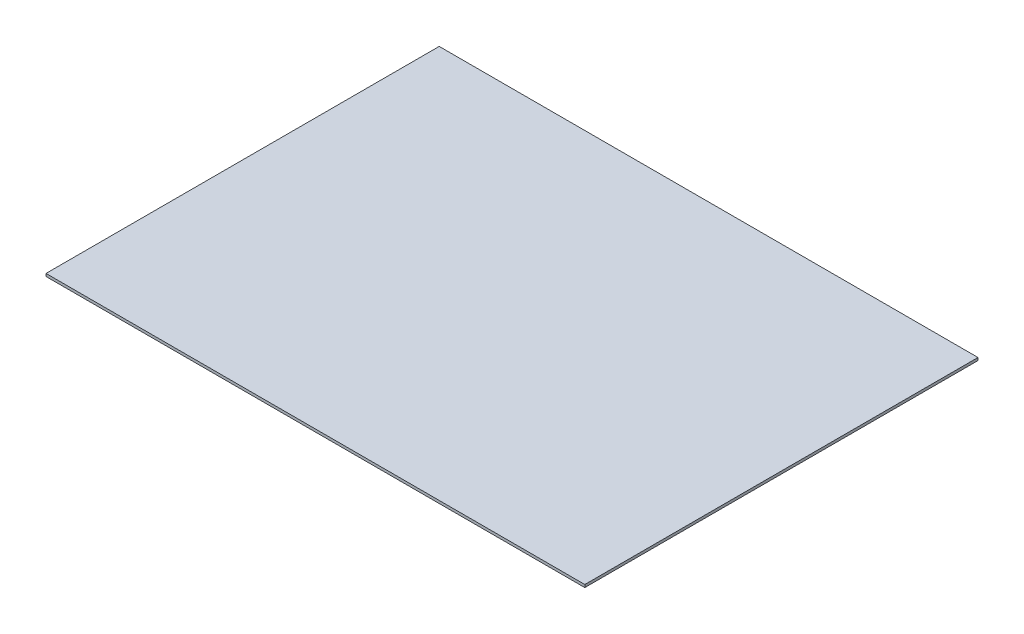
ISO-10303-21;
HEADER;
FILE_DESCRIPTION(('STEP AP214'),'2;1');
FILE_NAME('part.step','',(''),(''),'','','');
FILE_SCHEMA(('AUTOMOTIVE_DESIGN { 1 0 10303 214 1 1 1 1 }'));
ENDSEC;
DATA;
#1=APPLICATION_CONTEXT('core data for automotive mechanical design processes');
#2=APPLICATION_PROTOCOL_DEFINITION('international standard','automotive_design',2000,#1);
#3=PRODUCT_CONTEXT('',#1,'mechanical');
#4=PRODUCT('Part','Part','',(#3));
#5=PRODUCT_RELATED_PRODUCT_CATEGORY('part','',(#4));
#6=PRODUCT_DEFINITION_FORMATION('','',#4);
#7=PRODUCT_DEFINITION_CONTEXT('part definition',#1,'design');
#8=PRODUCT_DEFINITION('design','',#6,#7);
#9=PRODUCT_DEFINITION_SHAPE('','',#8);
#10=(LENGTH_UNIT() NAMED_UNIT(*) SI_UNIT(.MILLI.,.METRE.));
#11=(NAMED_UNIT(*) PLANE_ANGLE_UNIT() SI_UNIT($,.RADIAN.));
#12=(NAMED_UNIT(*) SI_UNIT($,.STERADIAN.) SOLID_ANGLE_UNIT());
#13=UNCERTAINTY_MEASURE_WITH_UNIT(LENGTH_MEASURE(1.E-05),#10,'distance_accuracy_value','');
#14=(GEOMETRIC_REPRESENTATION_CONTEXT(3) GLOBAL_UNCERTAINTY_ASSIGNED_CONTEXT((#13)) GLOBAL_UNIT_ASSIGNED_CONTEXT((#10,
#11,#12)) REPRESENTATION_CONTEXT('',''));
#15=CARTESIAN_POINT('',(0.,0.,0.));
#16=DIRECTION('',(0.,0.,1.));
#17=DIRECTION('',(1.,0.,0.));
#18=AXIS2_PLACEMENT_3D('',#15,#16,#17);
#19=CARTESIAN_POINT('',(200.895323539213,2.,-146.606378405248));
#20=DIRECTION('',(-1.,0.,0.));
#21=DIRECTION('',(0.,0.,1.));
#22=AXIS2_PLACEMENT_3D('',#19,#20,#21);
#23=PLANE('',#22);
#24=DIRECTION('',(0.,0.,-1.));
#25=VECTOR('',#24,1.);
#26=CARTESIAN_POINT('',(200.895323539213,0.,-146.606378405248));
#27=LINE('',#26,#25);
#28=CARTESIAN_POINT('',(200.895323539213,0.,146.606378405248));
#29=VERTEX_POINT('',#28);
#30=CARTESIAN_POINT('',(200.895323539213,0.,-146.606378405248));
#31=VERTEX_POINT('',#30);
#32=EDGE_CURVE('E100',#29,#31,#27,.T.);
#33=ORIENTED_EDGE('',*,*,#32,.T.);
#34=DIRECTION('',(0.,-1.,0.));
#35=VECTOR('',#34,1.);
#36=CARTESIAN_POINT('',(200.895323539213,2.,-146.606378405248));
#37=LINE('',#36,#35);
#38=CARTESIAN_POINT('',(200.895323539213,2.,-146.606378405248));
#39=VERTEX_POINT('',#38);
#40=EDGE_CURVE('E11',#39,#31,#37,.T.);
#41=ORIENTED_EDGE('',*,*,#40,.F.);
#42=DIRECTION('',(0.,0.,-1.));
#43=VECTOR('',#42,1.);
#44=CARTESIAN_POINT('',(200.895323539213,2.,-146.606378405248));
#45=LINE('',#44,#43);
#46=CARTESIAN_POINT('',(200.895323539213,2.,146.606378405248));
#47=VERTEX_POINT('',#46);
#48=EDGE_CURVE('E88',#47,#39,#45,.T.);
#49=ORIENTED_EDGE('',*,*,#48,.F.);
#50=DIRECTION('',(0.,-1.,0.));
#51=VECTOR('',#50,1.);
#52=CARTESIAN_POINT('',(200.895323539213,2.,146.606378405248));
#53=LINE('',#52,#51);
#54=EDGE_CURVE('E96',#47,#29,#53,.T.);
#55=ORIENTED_EDGE('',*,*,#54,.T.);
#56=EDGE_LOOP('',(#33,#41,#49,#55));
#57=FACE_BOUND('',#56,.T.);
#58=ADVANCED_FACE('F37',(#57),#23,.F.);
#59=CARTESIAN_POINT('',(-200.895323539213,2.,-146.606378405248));
#60=DIRECTION('',(0.,0.,1.));
#61=DIRECTION('',(1.,0.,0.));
#62=AXIS2_PLACEMENT_3D('',#59,#60,#61);
#63=PLANE('',#62);
#64=DIRECTION('',(-1.,0.,0.));
#65=VECTOR('',#64,1.);
#66=CARTESIAN_POINT('',(-200.895323539213,0.,-146.606378405248));
#67=LINE('',#66,#65);
#68=CARTESIAN_POINT('',(-200.895323539213,0.,-146.606378405248));
#69=VERTEX_POINT('',#68);
#70=EDGE_CURVE('E92',#31,#69,#67,.T.);
#71=ORIENTED_EDGE('',*,*,#70,.T.);
#72=DIRECTION('',(0.,-1.,0.));
#73=VECTOR('',#72,1.);
#74=CARTESIAN_POINT('',(-200.895323539213,2.,-146.606378405248));
#75=LINE('',#74,#73);
#76=CARTESIAN_POINT('',(-200.895323539213,2.,-146.606378405248));
#77=VERTEX_POINT('',#76);
#78=EDGE_CURVE('E45',#77,#69,#75,.T.);
#79=ORIENTED_EDGE('',*,*,#78,.F.);
#80=DIRECTION('',(-1.,0.,0.));
#81=VECTOR('',#80,1.);
#82=CARTESIAN_POINT('',(-200.895323539213,2.,-146.606378405248));
#83=LINE('',#82,#81);
#84=EDGE_CURVE('E83',#39,#77,#83,.T.);
#85=ORIENTED_EDGE('',*,*,#84,.F.);
#86=ORIENTED_EDGE('',*,*,#40,.T.);
#87=EDGE_LOOP('',(#71,#79,#85,#86));
#88=FACE_BOUND('',#87,.T.);
#89=ADVANCED_FACE('F91',(#88),#63,.F.);
#90=CARTESIAN_POINT('',(-200.895323539213,2.,-146.606378405248));
#91=DIRECTION('',(1.,0.,0.));
#92=DIRECTION('',(0.,0.,-1.));
#93=AXIS2_PLACEMENT_3D('',#90,#91,#92);
#94=PLANE('',#93);
#95=DIRECTION('',(0.,0.,1.));
#96=VECTOR('',#95,1.);
#97=CARTESIAN_POINT('',(-200.895323539213,0.,-146.606378405248));
#98=LINE('',#97,#96);
#99=CARTESIAN_POINT('',(-200.895323539213,0.,146.606378405248));
#100=VERTEX_POINT('',#99);
#101=EDGE_CURVE('E70',#69,#100,#98,.T.);
#102=ORIENTED_EDGE('',*,*,#101,.T.);
#103=DIRECTION('',(0.,-1.,0.));
#104=VECTOR('',#103,1.);
#105=CARTESIAN_POINT('',(-200.895323539213,2.,146.606378405248));
#106=LINE('',#105,#104);
#107=CARTESIAN_POINT('',(-200.895323539213,2.,146.606378405248));
#108=VERTEX_POINT('',#107);
#109=EDGE_CURVE('E93',#108,#100,#106,.T.);
#110=ORIENTED_EDGE('',*,*,#109,.F.);
#111=DIRECTION('',(0.,0.,1.));
#112=VECTOR('',#111,1.);
#113=CARTESIAN_POINT('',(-200.895323539213,2.,-146.606378405248));
#114=LINE('',#113,#112);
#115=EDGE_CURVE('E86',#77,#108,#114,.T.);
#116=ORIENTED_EDGE('',*,*,#115,.F.);
#117=ORIENTED_EDGE('',*,*,#78,.T.);
#118=EDGE_LOOP('',(#102,#110,#116,#117));
#119=FACE_BOUND('',#118,.T.);
#120=ADVANCED_FACE('F94',(#119),#94,.F.);
#121=CARTESIAN_POINT('',(-200.895323539213,2.,146.606378405248));
#122=DIRECTION('',(0.,0.,-1.));
#123=DIRECTION('',(-1.,0.,0.));
#124=AXIS2_PLACEMENT_3D('',#121,#122,#123);
#125=PLANE('',#124);
#126=DIRECTION('',(1.,0.,0.));
#127=VECTOR('',#126,1.);
#128=CARTESIAN_POINT('',(-200.895323539213,0.,146.606378405248));
#129=LINE('',#128,#127);
#130=EDGE_CURVE('E76',#100,#29,#129,.T.);
#131=ORIENTED_EDGE('',*,*,#130,.T.);
#132=ORIENTED_EDGE('',*,*,#54,.F.);
#133=DIRECTION('',(1.,0.,0.));
#134=VECTOR('',#133,1.);
#135=CARTESIAN_POINT('',(-200.895323539213,2.,146.606378405248));
#136=LINE('',#135,#134);
#137=EDGE_CURVE('E53',#108,#47,#136,.T.);
#138=ORIENTED_EDGE('',*,*,#137,.F.);
#139=ORIENTED_EDGE('',*,*,#109,.T.);
#140=EDGE_LOOP('',(#131,#132,#138,#139));
#141=FACE_BOUND('',#140,.T.);
#142=ADVANCED_FACE('F107',(#141),#125,.F.);
#143=CARTESIAN_POINT('',(0.,2.,0.));
#144=DIRECTION('',(0.,1.,0.));
#145=DIRECTION('',(0.,0.,1.));
#146=AXIS2_PLACEMENT_3D('',#143,#144,#145);
#147=PLANE('',#146);
#148=ORIENTED_EDGE('',*,*,#48,.T.);
#149=ORIENTED_EDGE('',*,*,#84,.T.);
#150=ORIENTED_EDGE('',*,*,#115,.T.);
#151=ORIENTED_EDGE('',*,*,#137,.T.);
#152=EDGE_LOOP('',(#148,#149,#150,#151));
#153=FACE_BOUND('',#152,.T.);
#154=ADVANCED_FACE('F84',(#153),#147,.T.);
#155=CARTESIAN_POINT('',(0.,0.,0.));
#156=DIRECTION('',(0.,1.,0.));
#157=DIRECTION('',(0.,0.,1.));
#158=AXIS2_PLACEMENT_3D('',#155,#156,#157);
#159=PLANE('',#158);
#160=ORIENTED_EDGE('',*,*,#32,.F.);
#161=ORIENTED_EDGE('',*,*,#130,.F.);
#162=ORIENTED_EDGE('',*,*,#101,.F.);
#163=ORIENTED_EDGE('',*,*,#70,.F.);
#164=EDGE_LOOP('',(#160,#161,#162,#163));
#165=FACE_BOUND('',#164,.T.);
#166=ADVANCED_FACE('F110',(#165),#159,.F.);
#167=CLOSED_SHELL('',(#58,#89,#120,#142,#154,#166));
#168=MANIFOLD_SOLID_BREP('B2',#167);
#169=ADVANCED_BREP_SHAPE_REPRESENTATION('',(#18,#168),#14);
#170=SHAPE_DEFINITION_REPRESENTATION(#9,#169);
ENDSEC;
END-ISO-10303-21;
